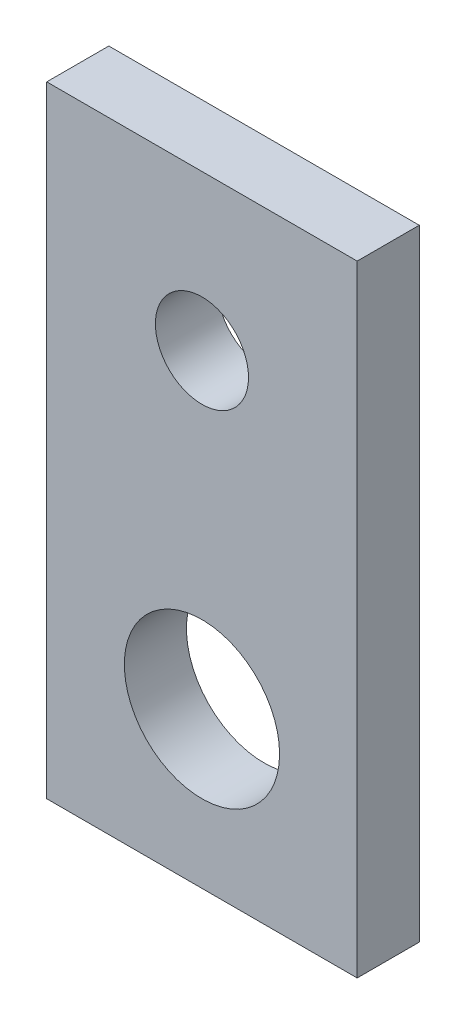
ISO-10303-21;
HEADER;
FILE_DESCRIPTION(('STEP AP214'),'2;1');
FILE_NAME('part.step','',(''),(''),'','','');
FILE_SCHEMA(('AUTOMOTIVE_DESIGN { 1 0 10303 214 1 1 1 1 }'));
ENDSEC;
DATA;
#1=APPLICATION_CONTEXT('core data for automotive mechanical design processes');
#2=APPLICATION_PROTOCOL_DEFINITION('international standard','automotive_design',2000,#1);
#3=PRODUCT_CONTEXT('',#1,'mechanical');
#4=PRODUCT('Part','Part','',(#3));
#5=PRODUCT_RELATED_PRODUCT_CATEGORY('part','',(#4));
#6=PRODUCT_DEFINITION_FORMATION('','',#4);
#7=PRODUCT_DEFINITION_CONTEXT('part definition',#1,'design');
#8=PRODUCT_DEFINITION('design','',#6,#7);
#9=PRODUCT_DEFINITION_SHAPE('','',#8);
#10=(LENGTH_UNIT() NAMED_UNIT(*) SI_UNIT(.MILLI.,.METRE.));
#11=(NAMED_UNIT(*) PLANE_ANGLE_UNIT() SI_UNIT($,.RADIAN.));
#12=(NAMED_UNIT(*) SI_UNIT($,.STERADIAN.) SOLID_ANGLE_UNIT());
#13=UNCERTAINTY_MEASURE_WITH_UNIT(LENGTH_MEASURE(1.E-05),#10,'distance_accuracy_value','');
#14=(GEOMETRIC_REPRESENTATION_CONTEXT(3) GLOBAL_UNCERTAINTY_ASSIGNED_CONTEXT((#13)) GLOBAL_UNIT_ASSIGNED_CONTEXT((#10,
#11,#12)) REPRESENTATION_CONTEXT('',''));
#15=CARTESIAN_POINT('',(0.,0.,0.));
#16=DIRECTION('',(0.,0.,1.));
#17=DIRECTION('',(1.,0.,0.));
#18=AXIS2_PLACEMENT_3D('',#15,#16,#17);
#19=CARTESIAN_POINT('',(0.,0.,2.));
#20=DIRECTION('',(0.,0.,1.));
#21=DIRECTION('',(1.,0.,0.));
#22=AXIS2_PLACEMENT_3D('',#19,#20,#21);
#23=PLANE('',#22);
#24=CARTESIAN_POINT('',(-5.,5.00259101596187,2.));
#25=DIRECTION('',(0.,0.,1.));
#26=DIRECTION('',(1.,0.,0.));
#27=AXIS2_PLACEMENT_3D('',#24,#25,#26);
#28=CIRCLE('',#27,1.5);
#29=CARTESIAN_POINT('',(-3.5,5.00259101596187,2.));
#30=VERTEX_POINT('',#29);
#31=EDGE_CURVE('E100',#30,#30,#28,.T.);
#32=ORIENTED_EDGE('',*,*,#31,.F.);
#33=EDGE_LOOP('',(#32));
#34=FACE_BOUND('',#33,.T.);
#35=DIRECTION('',(0.,-1.,0.));
#36=VECTOR('',#35,1.);
#37=CARTESIAN_POINT('',(-10.,10.,2.));
#38=LINE('',#37,#36);
#39=CARTESIAN_POINT('',(-10.,10.,2.));
#40=VERTEX_POINT('',#39);
#41=CARTESIAN_POINT('',(-10.,-10.,2.));
#42=VERTEX_POINT('',#41);
#43=EDGE_CURVE('E85',#40,#42,#38,.T.);
#44=ORIENTED_EDGE('',*,*,#43,.T.);
#45=DIRECTION('',(1.,0.,0.));
#46=VECTOR('',#45,1.);
#47=CARTESIAN_POINT('',(-10.,-10.,2.));
#48=LINE('',#47,#46);
#49=CARTESIAN_POINT('',(0.,-10.,2.));
#50=VERTEX_POINT('',#49);
#51=EDGE_CURVE('E80',#42,#50,#48,.T.);
#52=ORIENTED_EDGE('',*,*,#51,.T.);
#53=DIRECTION('',(0.,1.,0.));
#54=VECTOR('',#53,1.);
#55=CARTESIAN_POINT('',(0.,10.,2.));
#56=LINE('',#55,#54);
#57=CARTESIAN_POINT('',(0.,10.,2.));
#58=VERTEX_POINT('',#57);
#59=EDGE_CURVE('E83',#50,#58,#56,.T.);
#60=ORIENTED_EDGE('',*,*,#59,.T.);
#61=DIRECTION('',(-1.,0.,0.));
#62=VECTOR('',#61,1.);
#63=CARTESIAN_POINT('',(-10.,10.,2.));
#64=LINE('',#63,#62);
#65=EDGE_CURVE('E50',#58,#40,#64,.T.);
#66=ORIENTED_EDGE('',*,*,#65,.T.);
#67=EDGE_LOOP('',(#44,#52,#60,#66));
#68=FACE_BOUND('',#67,.T.);
#69=CARTESIAN_POINT('',(-5.,-5.,2.));
#70=DIRECTION('',(0.,0.,1.));
#71=DIRECTION('',(1.,0.,0.));
#72=AXIS2_PLACEMENT_3D('',#69,#70,#71);
#73=CIRCLE('',#72,2.5);
#74=CARTESIAN_POINT('',(-2.5,-5.,2.));
#75=VERTEX_POINT('',#74);
#76=EDGE_CURVE('E115',#75,#75,#73,.T.);
#77=ORIENTED_EDGE('',*,*,#76,.F.);
#78=EDGE_LOOP('',(#77));
#79=FACE_BOUND('',#78,.T.);
#80=ADVANCED_FACE('F33',(#34,#68,#79),#23,.T.);
#81=CARTESIAN_POINT('',(0.,0.,0.));
#82=DIRECTION('',(0.,0.,1.));
#83=DIRECTION('',(1.,0.,0.));
#84=AXIS2_PLACEMENT_3D('',#81,#82,#83);
#85=PLANE('',#84);
#86=CARTESIAN_POINT('',(-5.,5.00259101596187,0.));
#87=DIRECTION('',(0.,0.,1.));
#88=DIRECTION('',(1.,0.,0.));
#89=AXIS2_PLACEMENT_3D('',#86,#87,#88);
#90=CIRCLE('',#89,1.5);
#91=CARTESIAN_POINT('',(-3.5,5.00259101596187,0.));
#92=VERTEX_POINT('',#91);
#93=EDGE_CURVE('E112',#92,#92,#90,.T.);
#94=ORIENTED_EDGE('',*,*,#93,.T.);
#95=EDGE_LOOP('',(#94));
#96=FACE_BOUND('',#95,.T.);
#97=DIRECTION('',(0.,-1.,0.));
#98=VECTOR('',#97,1.);
#99=CARTESIAN_POINT('',(-10.,10.,0.));
#100=LINE('',#99,#98);
#101=CARTESIAN_POINT('',(-10.,10.,0.));
#102=VERTEX_POINT('',#101);
#103=CARTESIAN_POINT('',(-10.,-10.,0.));
#104=VERTEX_POINT('',#103);
#105=EDGE_CURVE('E97',#102,#104,#100,.T.);
#106=ORIENTED_EDGE('',*,*,#105,.F.);
#107=DIRECTION('',(-1.,0.,0.));
#108=VECTOR('',#107,1.);
#109=CARTESIAN_POINT('',(-10.,10.,0.));
#110=LINE('',#109,#108);
#111=CARTESIAN_POINT('',(0.,10.,0.));
#112=VERTEX_POINT('',#111);
#113=EDGE_CURVE('E73',#112,#102,#110,.T.);
#114=ORIENTED_EDGE('',*,*,#113,.F.);
#115=DIRECTION('',(0.,1.,0.));
#116=VECTOR('',#115,1.);
#117=CARTESIAN_POINT('',(0.,10.,0.));
#118=LINE('',#117,#116);
#119=CARTESIAN_POINT('',(0.,-10.,0.));
#120=VERTEX_POINT('',#119);
#121=EDGE_CURVE('E67',#120,#112,#118,.T.);
#122=ORIENTED_EDGE('',*,*,#121,.F.);
#123=DIRECTION('',(1.,0.,0.));
#124=VECTOR('',#123,1.);
#125=CARTESIAN_POINT('',(-10.,-10.,0.));
#126=LINE('',#125,#124);
#127=EDGE_CURVE('E89',#104,#120,#126,.T.);
#128=ORIENTED_EDGE('',*,*,#127,.F.);
#129=EDGE_LOOP('',(#106,#114,#122,#128));
#130=FACE_BOUND('',#129,.T.);
#131=CARTESIAN_POINT('',(-5.,-5.,0.));
#132=DIRECTION('',(0.,0.,1.));
#133=DIRECTION('',(1.,0.,0.));
#134=AXIS2_PLACEMENT_3D('',#131,#132,#133);
#135=CIRCLE('',#134,2.5);
#136=CARTESIAN_POINT('',(-2.5,-5.,0.));
#137=VERTEX_POINT('',#136);
#138=EDGE_CURVE('E118',#137,#137,#135,.T.);
#139=ORIENTED_EDGE('',*,*,#138,.T.);
#140=EDGE_LOOP('',(#139));
#141=FACE_BOUND('',#140,.T.);
#142=ADVANCED_FACE('F108',(#96,#130,#141),#85,.F.);
#143=CARTESIAN_POINT('',(-10.,10.,2.));
#144=DIRECTION('',(1.,0.,0.));
#145=DIRECTION('',(0.,1.,0.));
#146=AXIS2_PLACEMENT_3D('',#143,#144,#145);
#147=PLANE('',#146);
#148=ORIENTED_EDGE('',*,*,#105,.T.);
#149=DIRECTION('',(0.,0.,-1.));
#150=VECTOR('',#149,1.);
#151=CARTESIAN_POINT('',(-10.,-10.,2.));
#152=LINE('',#151,#150);
#153=EDGE_CURVE('E11',#42,#104,#152,.T.);
#154=ORIENTED_EDGE('',*,*,#153,.F.);
#155=ORIENTED_EDGE('',*,*,#43,.F.);
#156=DIRECTION('',(0.,0.,-1.));
#157=VECTOR('',#156,1.);
#158=CARTESIAN_POINT('',(-10.,10.,2.));
#159=LINE('',#158,#157);
#160=EDGE_CURVE('E93',#40,#102,#159,.T.);
#161=ORIENTED_EDGE('',*,*,#160,.T.);
#162=EDGE_LOOP('',(#148,#154,#155,#161));
#163=FACE_BOUND('',#162,.T.);
#164=ADVANCED_FACE('F35',(#163),#147,.F.);
#165=CARTESIAN_POINT('',(-10.,-10.,2.));
#166=DIRECTION('',(0.,1.,0.));
#167=DIRECTION('',(0.,0.,1.));
#168=AXIS2_PLACEMENT_3D('',#165,#166,#167);
#169=PLANE('',#168);
#170=ORIENTED_EDGE('',*,*,#127,.T.);
#171=DIRECTION('',(0.,0.,-1.));
#172=VECTOR('',#171,1.);
#173=CARTESIAN_POINT('',(0.,-10.,2.));
#174=LINE('',#173,#172);
#175=EDGE_CURVE('E42',#50,#120,#174,.T.);
#176=ORIENTED_EDGE('',*,*,#175,.F.);
#177=ORIENTED_EDGE('',*,*,#51,.F.);
#178=ORIENTED_EDGE('',*,*,#153,.T.);
#179=EDGE_LOOP('',(#170,#176,#177,#178));
#180=FACE_BOUND('',#179,.T.);
#181=ADVANCED_FACE('F88',(#180),#169,.F.);
#182=CARTESIAN_POINT('',(0.,10.,2.));
#183=DIRECTION('',(-1.,0.,0.));
#184=DIRECTION('',(0.,-1.,0.));
#185=AXIS2_PLACEMENT_3D('',#182,#183,#184);
#186=PLANE('',#185);
#187=ORIENTED_EDGE('',*,*,#121,.T.);
#188=DIRECTION('',(0.,0.,-1.));
#189=VECTOR('',#188,1.);
#190=CARTESIAN_POINT('',(0.,10.,2.));
#191=LINE('',#190,#189);
#192=EDGE_CURVE('E90',#58,#112,#191,.T.);
#193=ORIENTED_EDGE('',*,*,#192,.F.);
#194=ORIENTED_EDGE('',*,*,#59,.F.);
#195=ORIENTED_EDGE('',*,*,#175,.T.);
#196=EDGE_LOOP('',(#187,#193,#194,#195));
#197=FACE_BOUND('',#196,.T.);
#198=ADVANCED_FACE('F91',(#197),#186,.F.);
#199=CARTESIAN_POINT('',(-10.,10.,2.));
#200=DIRECTION('',(0.,-1.,0.));
#201=DIRECTION('',(0.,0.,-1.));
#202=AXIS2_PLACEMENT_3D('',#199,#200,#201);
#203=PLANE('',#202);
#204=ORIENTED_EDGE('',*,*,#113,.T.);
#205=ORIENTED_EDGE('',*,*,#160,.F.);
#206=ORIENTED_EDGE('',*,*,#65,.F.);
#207=ORIENTED_EDGE('',*,*,#192,.T.);
#208=EDGE_LOOP('',(#204,#205,#206,#207));
#209=FACE_BOUND('',#208,.T.);
#210=ADVANCED_FACE('F105',(#209),#203,.F.);
#211=CARTESIAN_POINT('',(-5.,5.00259101596187,2.));
#212=DIRECTION('',(0.,0.,-1.));
#213=DIRECTION('',(-1.,0.,0.));
#214=AXIS2_PLACEMENT_3D('',#211,#212,#213);
#215=CYLINDRICAL_SURFACE('',#214,1.5);
#216=ORIENTED_EDGE('',*,*,#31,.T.);
#217=EDGE_LOOP('',(#216));
#218=FACE_BOUND('',#217,.T.);
#219=ORIENTED_EDGE('',*,*,#93,.F.);
#220=EDGE_LOOP('',(#219));
#221=FACE_BOUND('',#220,.T.);
#222=ADVANCED_FACE('F136',(#218,#221),#215,.F.);
#223=CARTESIAN_POINT('',(-5.,-5.,2.));
#224=DIRECTION('',(0.,0.,-1.));
#225=DIRECTION('',(-1.,0.,0.));
#226=AXIS2_PLACEMENT_3D('',#223,#224,#225);
#227=CYLINDRICAL_SURFACE('',#226,2.5);
#228=ORIENTED_EDGE('',*,*,#76,.T.);
#229=EDGE_LOOP('',(#228));
#230=FACE_BOUND('',#229,.T.);
#231=ORIENTED_EDGE('',*,*,#138,.F.);
#232=EDGE_LOOP('',(#231));
#233=FACE_BOUND('',#232,.T.);
#234=ADVANCED_FACE('F124',(#230,#233),#227,.F.);
#235=CLOSED_SHELL('',(#80,#142,#164,#181,#198,#210,#222,#234));
#236=MANIFOLD_SOLID_BREP('B2',#235);
#237=ADVANCED_BREP_SHAPE_REPRESENTATION('',(#18,#236),#14);
#238=SHAPE_DEFINITION_REPRESENTATION(#9,#237);
ENDSEC;
END-ISO-10303-21;
